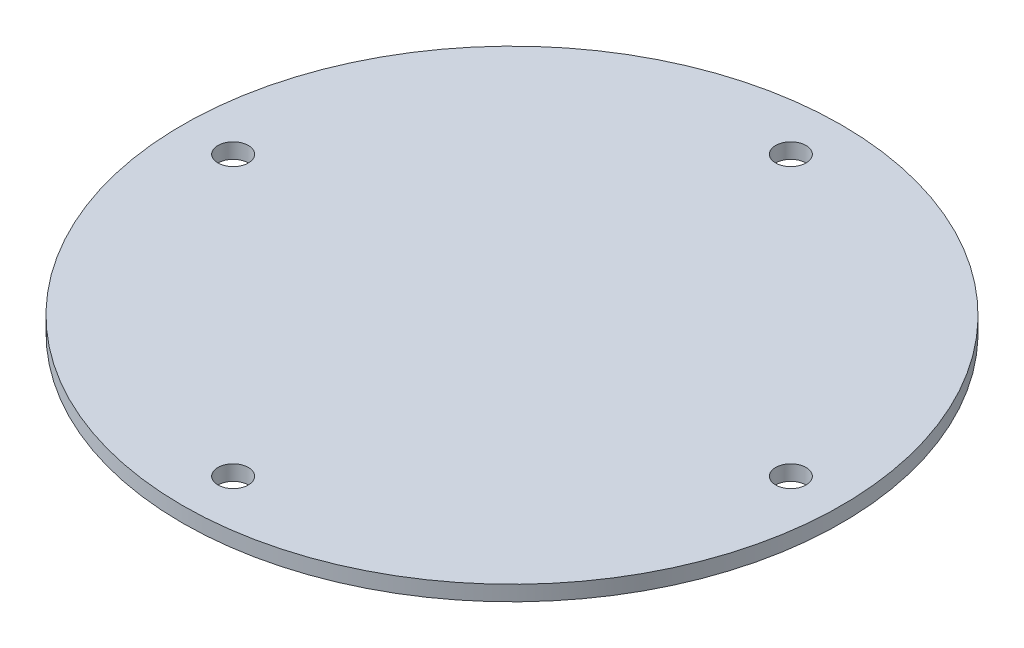
ISO-10303-21;
HEADER;
FILE_DESCRIPTION(('STEP AP214'),'2;1');
FILE_NAME('part.step','',(''),(''),'','','');
FILE_SCHEMA(('AUTOMOTIVE_DESIGN { 1 0 10303 214 1 1 1 1 }'));
ENDSEC;
DATA;
#1=APPLICATION_CONTEXT('core data for automotive mechanical design processes');
#2=APPLICATION_PROTOCOL_DEFINITION('international standard','automotive_design',2000,#1);
#3=PRODUCT_CONTEXT('',#1,'mechanical');
#4=PRODUCT('Part','Part','',(#3));
#5=PRODUCT_RELATED_PRODUCT_CATEGORY('part','',(#4));
#6=PRODUCT_DEFINITION_FORMATION('','',#4);
#7=PRODUCT_DEFINITION_CONTEXT('part definition',#1,'design');
#8=PRODUCT_DEFINITION('design','',#6,#7);
#9=PRODUCT_DEFINITION_SHAPE('','',#8);
#10=(LENGTH_UNIT() NAMED_UNIT(*) SI_UNIT(.MILLI.,.METRE.));
#11=(NAMED_UNIT(*) PLANE_ANGLE_UNIT() SI_UNIT($,.RADIAN.));
#12=(NAMED_UNIT(*) SI_UNIT($,.STERADIAN.) SOLID_ANGLE_UNIT());
#13=UNCERTAINTY_MEASURE_WITH_UNIT(LENGTH_MEASURE(1.E-05),#10,'distance_accuracy_value','');
#14=(GEOMETRIC_REPRESENTATION_CONTEXT(3) GLOBAL_UNCERTAINTY_ASSIGNED_CONTEXT((#13)) GLOBAL_UNIT_ASSIGNED_CONTEXT((#10,
#11,#12)) REPRESENTATION_CONTEXT('',''));
#15=CARTESIAN_POINT('',(0.,0.,0.));
#16=DIRECTION('',(0.,0.,1.));
#17=DIRECTION('',(1.,0.,0.));
#18=AXIS2_PLACEMENT_3D('',#15,#16,#17);
#19=CARTESIAN_POINT('',(0.,3.,0.));
#20=DIRECTION('',(0.,-1.,0.));
#21=DIRECTION('',(0.,0.,-1.));
#22=AXIS2_PLACEMENT_3D('',#19,#20,#21);
#23=CYLINDRICAL_SURFACE('',#22,65.);
#24=CARTESIAN_POINT('',(0.,3.,0.));
#25=DIRECTION('',(0.,1.,0.));
#26=DIRECTION('',(0.,0.,1.));
#27=AXIS2_PLACEMENT_3D('',#24,#25,#26);
#28=CIRCLE('',#27,65.);
#29=CARTESIAN_POINT('',(0.,3.,65.));
#30=VERTEX_POINT('',#29);
#31=EDGE_CURVE('E10',#30,#30,#28,.T.);
#32=ORIENTED_EDGE('',*,*,#31,.F.);
#33=EDGE_LOOP('',(#32));
#34=FACE_BOUND('',#33,.T.);
#35=CARTESIAN_POINT('',(0.,0.,0.));
#36=DIRECTION('',(0.,1.,0.));
#37=DIRECTION('',(0.,0.,1.));
#38=AXIS2_PLACEMENT_3D('',#35,#36,#37);
#39=CIRCLE('',#38,65.);
#40=CARTESIAN_POINT('',(0.,0.,65.));
#41=VERTEX_POINT('',#40);
#42=EDGE_CURVE('E36',#41,#41,#39,.T.);
#43=ORIENTED_EDGE('',*,*,#42,.T.);
#44=EDGE_LOOP('',(#43));
#45=FACE_BOUND('',#44,.T.);
#46=ADVANCED_FACE('F33',(#34,#45),#23,.T.);
#47=CARTESIAN_POINT('',(0.,3.,0.));
#48=DIRECTION('',(0.,1.,0.));
#49=DIRECTION('',(0.,0.,1.));
#50=AXIS2_PLACEMENT_3D('',#47,#48,#49);
#51=PLANE('',#50);
#52=CARTESIAN_POINT('',(-55.,3.,1.92031473636372E-13));
#53=DIRECTION('',(0.,1.,0.));
#54=DIRECTION('',(1.,0.,0.));
#55=AXIS2_PLACEMENT_3D('',#52,#53,#54);
#56=CIRCLE('',#55,3.);
#57=CARTESIAN_POINT('',(-52.,3.,1.81557029619843E-13));
#58=VERTEX_POINT('',#57);
#59=EDGE_CURVE('E48',#58,#58,#56,.T.);
#60=ORIENTED_EDGE('',*,*,#59,.F.);
#61=EDGE_LOOP('',(#60));
#62=FACE_BOUND('',#61,.T.);
#63=CARTESIAN_POINT('',(0.,3.,55.));
#64=DIRECTION('',(0.,1.,0.));
#65=DIRECTION('',(0.,0.,-1.));
#66=AXIS2_PLACEMENT_3D('',#63,#64,#65);
#67=CIRCLE('',#66,3.);
#68=CARTESIAN_POINT('',(0.,3.,52.));
#69=VERTEX_POINT('',#68);
#70=EDGE_CURVE('E58',#69,#69,#67,.T.);
#71=ORIENTED_EDGE('',*,*,#70,.F.);
#72=EDGE_LOOP('',(#71));
#73=FACE_BOUND('',#72,.T.);
#74=CARTESIAN_POINT('',(55.,3.,-5.76094420909117E-13));
#75=DIRECTION('',(0.,1.,0.));
#76=DIRECTION('',(-1.,0.,0.));
#77=AXIS2_PLACEMENT_3D('',#74,#75,#76);
#78=CIRCLE('',#77,3.);
#79=CARTESIAN_POINT('',(52.,3.,-5.44671088859529E-13));
#80=VERTEX_POINT('',#79);
#81=EDGE_CURVE('E51',#80,#80,#78,.T.);
#82=ORIENTED_EDGE('',*,*,#81,.F.);
#83=EDGE_LOOP('',(#82));
#84=FACE_BOUND('',#83,.T.);
#85=CARTESIAN_POINT('',(0.,3.,-55.));
#86=DIRECTION('',(0.,1.,0.));
#87=DIRECTION('',(0.,0.,1.));
#88=AXIS2_PLACEMENT_3D('',#85,#86,#87);
#89=CIRCLE('',#88,3.);
#90=CARTESIAN_POINT('',(0.,3.,-52.));
#91=VERTEX_POINT('',#90);
#92=EDGE_CURVE('E45',#91,#91,#89,.T.);
#93=ORIENTED_EDGE('',*,*,#92,.F.);
#94=EDGE_LOOP('',(#93));
#95=FACE_BOUND('',#94,.T.);
#96=ORIENTED_EDGE('',*,*,#31,.T.);
#97=EDGE_LOOP('',(#96));
#98=FACE_BOUND('',#97,.T.);
#99=ADVANCED_FACE('F79',(#62,#73,#84,#95,#98),#51,.T.);
#100=CARTESIAN_POINT('',(0.,0.,0.));
#101=DIRECTION('',(0.,1.,0.));
#102=DIRECTION('',(0.,0.,1.));
#103=AXIS2_PLACEMENT_3D('',#100,#101,#102);
#104=PLANE('',#103);
#105=CARTESIAN_POINT('',(-55.,0.,1.92031473636372E-13));
#106=DIRECTION('',(0.,1.,0.));
#107=DIRECTION('',(1.,0.,0.));
#108=AXIS2_PLACEMENT_3D('',#105,#106,#107);
#109=CIRCLE('',#108,3.);
#110=CARTESIAN_POINT('',(-52.,0.,1.81557029619843E-13));
#111=VERTEX_POINT('',#110);
#112=EDGE_CURVE('E61',#111,#111,#109,.T.);
#113=ORIENTED_EDGE('',*,*,#112,.T.);
#114=EDGE_LOOP('',(#113));
#115=FACE_BOUND('',#114,.T.);
#116=CARTESIAN_POINT('',(0.,0.,55.));
#117=DIRECTION('',(0.,1.,0.));
#118=DIRECTION('',(0.,0.,-1.));
#119=AXIS2_PLACEMENT_3D('',#116,#117,#118);
#120=CIRCLE('',#119,3.);
#121=CARTESIAN_POINT('',(0.,0.,52.));
#122=VERTEX_POINT('',#121);
#123=EDGE_CURVE('E54',#122,#122,#120,.T.);
#124=ORIENTED_EDGE('',*,*,#123,.T.);
#125=EDGE_LOOP('',(#124));
#126=FACE_BOUND('',#125,.T.);
#127=CARTESIAN_POINT('',(55.,0.,-5.76094420909117E-13));
#128=DIRECTION('',(0.,1.,0.));
#129=DIRECTION('',(-1.,0.,0.));
#130=AXIS2_PLACEMENT_3D('',#127,#128,#129);
#131=CIRCLE('',#130,3.);
#132=CARTESIAN_POINT('',(52.,0.,-5.44671088859529E-13));
#133=VERTEX_POINT('',#132);
#134=EDGE_CURVE('E55',#133,#133,#131,.T.);
#135=ORIENTED_EDGE('',*,*,#134,.T.);
#136=EDGE_LOOP('',(#135));
#137=FACE_BOUND('',#136,.T.);
#138=CARTESIAN_POINT('',(0.,0.,-55.));
#139=DIRECTION('',(0.,1.,0.));
#140=DIRECTION('',(0.,0.,1.));
#141=AXIS2_PLACEMENT_3D('',#138,#139,#140);
#142=CIRCLE('',#141,3.);
#143=CARTESIAN_POINT('',(0.,0.,-52.));
#144=VERTEX_POINT('',#143);
#145=EDGE_CURVE('E43',#144,#144,#142,.T.);
#146=ORIENTED_EDGE('',*,*,#145,.T.);
#147=EDGE_LOOP('',(#146));
#148=FACE_BOUND('',#147,.T.);
#149=ORIENTED_EDGE('',*,*,#42,.F.);
#150=EDGE_LOOP('',(#149));
#151=FACE_BOUND('',#150,.T.);
#152=ADVANCED_FACE('F69',(#115,#126,#137,#148,#151),#104,.F.);
#153=CARTESIAN_POINT('',(0.,0.,-55.));
#154=DIRECTION('',(0.,1.,0.));
#155=DIRECTION('',(0.,0.,1.));
#156=AXIS2_PLACEMENT_3D('',#153,#154,#155);
#157=CYLINDRICAL_SURFACE('',#156,3.);
#158=ORIENTED_EDGE('',*,*,#145,.F.);
#159=EDGE_LOOP('',(#158));
#160=FACE_BOUND('',#159,.T.);
#161=ORIENTED_EDGE('',*,*,#92,.T.);
#162=EDGE_LOOP('',(#161));
#163=FACE_BOUND('',#162,.T.);
#164=ADVANCED_FACE('F89',(#160,#163),#157,.F.);
#165=CARTESIAN_POINT('',(55.,0.,-5.76094420909117E-13));
#166=DIRECTION('',(0.,1.,0.));
#167=DIRECTION('',(-1.,0.,0.));
#168=AXIS2_PLACEMENT_3D('',#165,#166,#167);
#169=CYLINDRICAL_SURFACE('',#168,3.);
#170=ORIENTED_EDGE('',*,*,#134,.F.);
#171=EDGE_LOOP('',(#170));
#172=FACE_BOUND('',#171,.T.);
#173=ORIENTED_EDGE('',*,*,#81,.T.);
#174=EDGE_LOOP('',(#173));
#175=FACE_BOUND('',#174,.T.);
#176=ADVANCED_FACE('F91',(#172,#175),#169,.F.);
#177=CARTESIAN_POINT('',(0.,0.,55.));
#178=DIRECTION('',(0.,1.,0.));
#179=DIRECTION('',(0.,0.,-1.));
#180=AXIS2_PLACEMENT_3D('',#177,#178,#179);
#181=CYLINDRICAL_SURFACE('',#180,3.);
#182=ORIENTED_EDGE('',*,*,#123,.F.);
#183=EDGE_LOOP('',(#182));
#184=FACE_BOUND('',#183,.T.);
#185=ORIENTED_EDGE('',*,*,#70,.T.);
#186=EDGE_LOOP('',(#185));
#187=FACE_BOUND('',#186,.T.);
#188=ADVANCED_FACE('F75',(#184,#187),#181,.F.);
#189=CARTESIAN_POINT('',(-55.,0.,1.92031473636372E-13));
#190=DIRECTION('',(0.,1.,0.));
#191=DIRECTION('',(1.,0.,0.));
#192=AXIS2_PLACEMENT_3D('',#189,#190,#191);
#193=CYLINDRICAL_SURFACE('',#192,3.);
#194=ORIENTED_EDGE('',*,*,#112,.F.);
#195=EDGE_LOOP('',(#194));
#196=FACE_BOUND('',#195,.T.);
#197=ORIENTED_EDGE('',*,*,#59,.T.);
#198=EDGE_LOOP('',(#197));
#199=FACE_BOUND('',#198,.T.);
#200=ADVANCED_FACE('F72',(#196,#199),#193,.F.);
#201=CLOSED_SHELL('',(#46,#99,#152,#164,#176,#188,#200));
#202=MANIFOLD_SOLID_BREP('B2',#201);
#203=ADVANCED_BREP_SHAPE_REPRESENTATION('',(#18,#202),#14);
#204=SHAPE_DEFINITION_REPRESENTATION(#9,#203);
ENDSEC;
END-ISO-10303-21;
